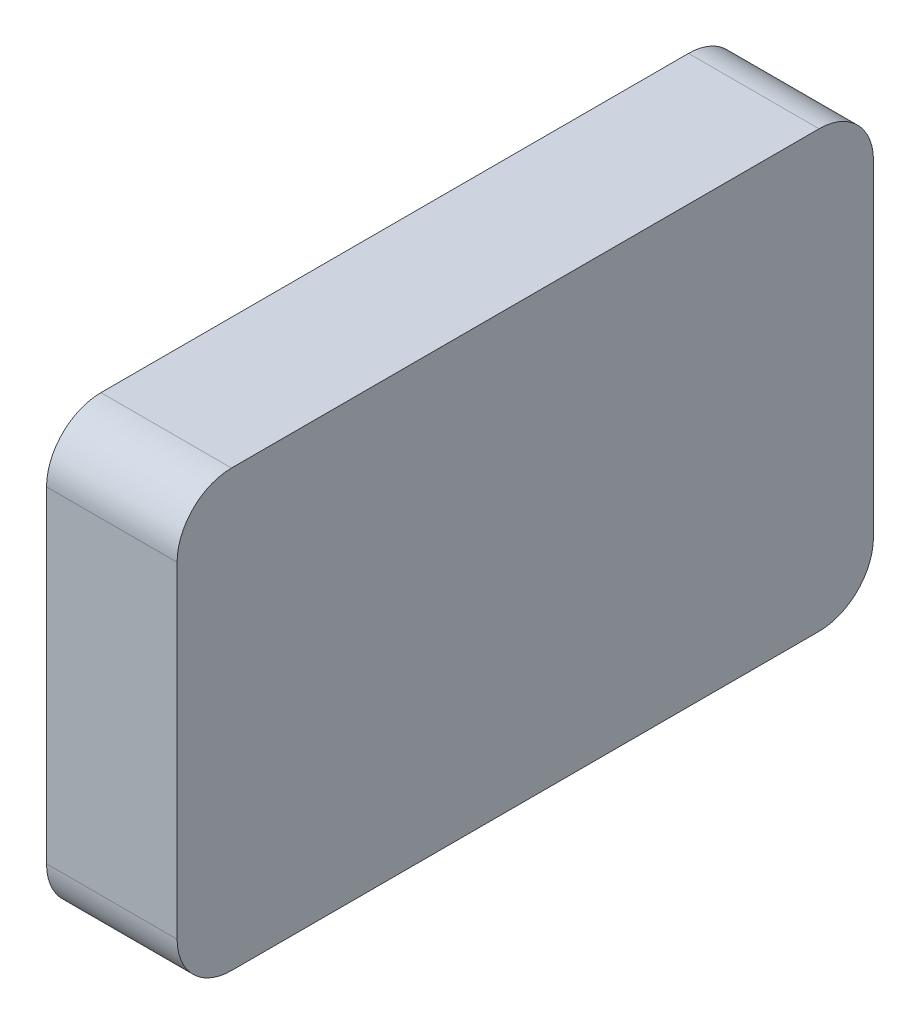
ISO-10303-21;
HEADER;
FILE_DESCRIPTION(('STEP AP214'),'2;1');
FILE_NAME('part.step','',(''),(''),'','','');
FILE_SCHEMA(('AUTOMOTIVE_DESIGN { 1 0 10303 214 1 1 1 1 }'));
ENDSEC;
DATA;
#1=APPLICATION_CONTEXT('core data for automotive mechanical design processes');
#2=APPLICATION_PROTOCOL_DEFINITION('international standard','automotive_design',2000,#1);
#3=PRODUCT_CONTEXT('',#1,'mechanical');
#4=PRODUCT('Part','Part','',(#3));
#5=PRODUCT_RELATED_PRODUCT_CATEGORY('part','',(#4));
#6=PRODUCT_DEFINITION_FORMATION('','',#4);
#7=PRODUCT_DEFINITION_CONTEXT('part definition',#1,'design');
#8=PRODUCT_DEFINITION('design','',#6,#7);
#9=PRODUCT_DEFINITION_SHAPE('','',#8);
#10=(LENGTH_UNIT() NAMED_UNIT(*) SI_UNIT(.MILLI.,.METRE.));
#11=(NAMED_UNIT(*) PLANE_ANGLE_UNIT() SI_UNIT($,.RADIAN.));
#12=(NAMED_UNIT(*) SI_UNIT($,.STERADIAN.) SOLID_ANGLE_UNIT());
#13=UNCERTAINTY_MEASURE_WITH_UNIT(LENGTH_MEASURE(1.E-05),#10,'distance_accuracy_value','');
#14=(GEOMETRIC_REPRESENTATION_CONTEXT(3) GLOBAL_UNCERTAINTY_ASSIGNED_CONTEXT((#13)) GLOBAL_UNIT_ASSIGNED_CONTEXT((#10,
#11,#12)) REPRESENTATION_CONTEXT('',''));
#15=CARTESIAN_POINT('',(0.,0.,0.));
#16=DIRECTION('',(0.,0.,1.));
#17=DIRECTION('',(1.,0.,0.));
#18=AXIS2_PLACEMENT_3D('',#15,#16,#17);
#19=CARTESIAN_POINT('',(12.,15.,-27.));
#20=DIRECTION('',(-1.,0.,0.));
#21=DIRECTION('',(0.,0.,1.));
#22=AXIS2_PLACEMENT_3D('',#19,#20,#21);
#23=CYLINDRICAL_SURFACE('',#22,5.00000000000001);
#24=CARTESIAN_POINT('',(0.,15.,-27.));
#25=DIRECTION('',(1.,0.,0.));
#26=DIRECTION('',(0.,0.,1.));
#27=AXIS2_PLACEMENT_3D('',#24,#25,#26);
#28=CIRCLE('',#27,5.00000000000001);
#29=CARTESIAN_POINT('',(0.,15.,-32.));
#30=VERTEX_POINT('',#29);
#31=CARTESIAN_POINT('',(0.,20.,-27.));
#32=VERTEX_POINT('',#31);
#33=EDGE_CURVE('E130',#30,#32,#28,.T.);
#34=ORIENTED_EDGE('',*,*,#33,.T.);
#35=DIRECTION('',(-1.,0.,0.));
#36=VECTOR('',#35,1.);
#37=CARTESIAN_POINT('',(12.,20.,-27.));
#38=LINE('',#37,#36);
#39=CARTESIAN_POINT('',(12.,20.,-27.));
#40=VERTEX_POINT('',#39);
#41=EDGE_CURVE('E11',#40,#32,#38,.T.);
#42=ORIENTED_EDGE('',*,*,#41,.F.);
#43=CARTESIAN_POINT('',(12.,15.,-27.));
#44=DIRECTION('',(1.,0.,0.));
#45=DIRECTION('',(0.,0.,1.));
#46=AXIS2_PLACEMENT_3D('',#43,#44,#45);
#47=CIRCLE('',#46,5.00000000000001);
#48=CARTESIAN_POINT('',(12.,15.,-32.));
#49=VERTEX_POINT('',#48);
#50=EDGE_CURVE('E145',#49,#40,#47,.T.);
#51=ORIENTED_EDGE('',*,*,#50,.F.);
#52=DIRECTION('',(-1.,0.,0.));
#53=VECTOR('',#52,1.);
#54=CARTESIAN_POINT('',(12.,15.,-32.));
#55=LINE('',#54,#53);
#56=EDGE_CURVE('E126',#49,#30,#55,.T.);
#57=ORIENTED_EDGE('',*,*,#56,.T.);
#58=EDGE_LOOP('',(#34,#42,#51,#57));
#59=FACE_BOUND('',#58,.T.);
#60=ADVANCED_FACE('F34',(#59),#23,.T.);
#61=CARTESIAN_POINT('',(12.,20.,27.));
#62=DIRECTION('',(0.,-1.,0.));
#63=DIRECTION('',(0.,0.,-1.));
#64=AXIS2_PLACEMENT_3D('',#61,#62,#63);
#65=PLANE('',#64);
#66=DIRECTION('',(0.,0.,1.));
#67=VECTOR('',#66,1.);
#68=CARTESIAN_POINT('',(0.,20.,27.));
#69=LINE('',#68,#67);
#70=CARTESIAN_POINT('',(0.,20.,27.));
#71=VERTEX_POINT('',#70);
#72=EDGE_CURVE('E133',#32,#71,#69,.T.);
#73=ORIENTED_EDGE('',*,*,#72,.T.);
#74=DIRECTION('',(-1.,0.,0.));
#75=VECTOR('',#74,1.);
#76=CARTESIAN_POINT('',(12.,20.,27.));
#77=LINE('',#76,#75);
#78=CARTESIAN_POINT('',(12.,20.,27.));
#79=VERTEX_POINT('',#78);
#80=EDGE_CURVE('E42',#79,#71,#77,.T.);
#81=ORIENTED_EDGE('',*,*,#80,.F.);
#82=DIRECTION('',(0.,0.,1.));
#83=VECTOR('',#82,1.);
#84=CARTESIAN_POINT('',(12.,20.,27.));
#85=LINE('',#84,#83);
#86=EDGE_CURVE('E93',#40,#79,#85,.T.);
#87=ORIENTED_EDGE('',*,*,#86,.F.);
#88=ORIENTED_EDGE('',*,*,#41,.T.);
#89=EDGE_LOOP('',(#73,#81,#87,#88));
#90=FACE_BOUND('',#89,.T.);
#91=ADVANCED_FACE('F209',(#90),#65,.F.);
#92=CARTESIAN_POINT('',(12.,15.,27.));
#93=DIRECTION('',(-1.,0.,0.));
#94=DIRECTION('',(0.,0.,1.));
#95=AXIS2_PLACEMENT_3D('',#92,#93,#94);
#96=CYLINDRICAL_SURFACE('',#95,5.);
#97=CARTESIAN_POINT('',(0.,15.,27.));
#98=DIRECTION('',(1.,0.,0.));
#99=DIRECTION('',(0.,0.,1.));
#100=AXIS2_PLACEMENT_3D('',#97,#98,#99);
#101=CIRCLE('',#100,5.);
#102=CARTESIAN_POINT('',(0.,15.,32.));
#103=VERTEX_POINT('',#102);
#104=EDGE_CURVE('E136',#71,#103,#101,.T.);
#105=ORIENTED_EDGE('',*,*,#104,.T.);
#106=DIRECTION('',(-1.,0.,0.));
#107=VECTOR('',#106,1.);
#108=CARTESIAN_POINT('',(12.,15.,32.));
#109=LINE('',#108,#107);
#110=CARTESIAN_POINT('',(12.,15.,32.));
#111=VERTEX_POINT('',#110);
#112=EDGE_CURVE('E152',#111,#103,#109,.T.);
#113=ORIENTED_EDGE('',*,*,#112,.F.);
#114=CARTESIAN_POINT('',(12.,15.,27.));
#115=DIRECTION('',(1.,0.,0.));
#116=DIRECTION('',(0.,0.,1.));
#117=AXIS2_PLACEMENT_3D('',#114,#115,#116);
#118=CIRCLE('',#117,5.);
#119=EDGE_CURVE('E160',#79,#111,#118,.T.);
#120=ORIENTED_EDGE('',*,*,#119,.F.);
#121=ORIENTED_EDGE('',*,*,#80,.T.);
#122=EDGE_LOOP('',(#105,#113,#120,#121));
#123=FACE_BOUND('',#122,.T.);
#124=ADVANCED_FACE('F158',(#123),#96,.T.);
#125=CARTESIAN_POINT('',(12.,15.,32.));
#126=DIRECTION('',(0.,0.,-1.));
#127=DIRECTION('',(-1.,0.,0.));
#128=AXIS2_PLACEMENT_3D('',#125,#126,#127);
#129=PLANE('',#128);
#130=DIRECTION('',(0.,-1.,0.));
#131=VECTOR('',#130,1.);
#132=CARTESIAN_POINT('',(0.,15.,32.));
#133=LINE('',#132,#131);
#134=CARTESIAN_POINT('',(0.,-15.,32.));
#135=VERTEX_POINT('',#134);
#136=EDGE_CURVE('E138',#103,#135,#133,.T.);
#137=ORIENTED_EDGE('',*,*,#136,.T.);
#138=DIRECTION('',(-1.,0.,0.));
#139=VECTOR('',#138,1.);
#140=CARTESIAN_POINT('',(12.,-15.,32.));
#141=LINE('',#140,#139);
#142=CARTESIAN_POINT('',(12.,-15.,32.));
#143=VERTEX_POINT('',#142);
#144=EDGE_CURVE('E149',#143,#135,#141,.T.);
#145=ORIENTED_EDGE('',*,*,#144,.F.);
#146=DIRECTION('',(0.,-1.,0.));
#147=VECTOR('',#146,1.);
#148=CARTESIAN_POINT('',(12.,15.,32.));
#149=LINE('',#148,#147);
#150=EDGE_CURVE('E172',#111,#143,#149,.T.);
#151=ORIENTED_EDGE('',*,*,#150,.F.);
#152=ORIENTED_EDGE('',*,*,#112,.T.);
#153=EDGE_LOOP('',(#137,#145,#151,#152));
#154=FACE_BOUND('',#153,.T.);
#155=ADVANCED_FACE('F168',(#154),#129,.F.);
#156=CARTESIAN_POINT('',(12.,-15.,27.));
#157=DIRECTION('',(-1.,0.,0.));
#158=DIRECTION('',(0.,0.,1.));
#159=AXIS2_PLACEMENT_3D('',#156,#157,#158);
#160=CYLINDRICAL_SURFACE('',#159,5.);
#161=CARTESIAN_POINT('',(0.,-15.,27.));
#162=DIRECTION('',(1.,0.,0.));
#163=DIRECTION('',(0.,0.,1.));
#164=AXIS2_PLACEMENT_3D('',#161,#162,#163);
#165=CIRCLE('',#164,5.);
#166=CARTESIAN_POINT('',(0.,-20.,27.));
#167=VERTEX_POINT('',#166);
#168=EDGE_CURVE('E140',#135,#167,#165,.T.);
#169=ORIENTED_EDGE('',*,*,#168,.T.);
#170=DIRECTION('',(-1.,0.,0.));
#171=VECTOR('',#170,1.);
#172=CARTESIAN_POINT('',(12.,-20.,27.));
#173=LINE('',#172,#171);
#174=CARTESIAN_POINT('',(12.,-20.,27.));
#175=VERTEX_POINT('',#174);
#176=EDGE_CURVE('E121',#175,#167,#173,.T.);
#177=ORIENTED_EDGE('',*,*,#176,.F.);
#178=CARTESIAN_POINT('',(12.,-15.,27.));
#179=DIRECTION('',(1.,0.,0.));
#180=DIRECTION('',(0.,0.,1.));
#181=AXIS2_PLACEMENT_3D('',#178,#179,#180);
#182=CIRCLE('',#181,5.);
#183=EDGE_CURVE('E112',#143,#175,#182,.T.);
#184=ORIENTED_EDGE('',*,*,#183,.F.);
#185=ORIENTED_EDGE('',*,*,#144,.T.);
#186=EDGE_LOOP('',(#169,#177,#184,#185));
#187=FACE_BOUND('',#186,.T.);
#188=ADVANCED_FACE('F171',(#187),#160,.T.);
#189=CARTESIAN_POINT('',(12.,-20.,27.));
#190=DIRECTION('',(0.,1.,0.));
#191=DIRECTION('',(0.,0.,1.));
#192=AXIS2_PLACEMENT_3D('',#189,#190,#191);
#193=PLANE('',#192);
#194=CARTESIAN_POINT('',(4.,-20.,0.));
#195=DIRECTION('',(0.,-1.,0.));
#196=DIRECTION('',(0.,0.,-1.));
#197=AXIS2_PLACEMENT_3D('',#194,#195,#196);
#198=CIRCLE('',#197,2.5);
#199=CARTESIAN_POINT('',(4.,-20.,-2.5));
#200=VERTEX_POINT('',#199);
#201=EDGE_CURVE('E184',#200,#200,#198,.T.);
#202=ORIENTED_EDGE('',*,*,#201,.F.);
#203=EDGE_LOOP('',(#202));
#204=FACE_BOUND('',#203,.T.);
#205=DIRECTION('',(0.,0.,-1.));
#206=VECTOR('',#205,1.);
#207=CARTESIAN_POINT('',(0.,-20.,27.));
#208=LINE('',#207,#206);
#209=CARTESIAN_POINT('',(0.,-20.,-27.));
#210=VERTEX_POINT('',#209);
#211=EDGE_CURVE('E120',#167,#210,#208,.T.);
#212=ORIENTED_EDGE('',*,*,#211,.T.);
#213=DIRECTION('',(-1.,0.,0.));
#214=VECTOR('',#213,1.);
#215=CARTESIAN_POINT('',(12.,-20.,-27.));
#216=LINE('',#215,#214);
#217=CARTESIAN_POINT('',(12.,-20.,-27.));
#218=VERTEX_POINT('',#217);
#219=EDGE_CURVE('E117',#218,#210,#216,.T.);
#220=ORIENTED_EDGE('',*,*,#219,.F.);
#221=DIRECTION('',(0.,0.,-1.));
#222=VECTOR('',#221,1.);
#223=CARTESIAN_POINT('',(12.,-20.,27.));
#224=LINE('',#223,#222);
#225=EDGE_CURVE('E106',#175,#218,#224,.T.);
#226=ORIENTED_EDGE('',*,*,#225,.F.);
#227=ORIENTED_EDGE('',*,*,#176,.T.);
#228=EDGE_LOOP('',(#212,#220,#226,#227));
#229=FACE_BOUND('',#228,.T.);
#230=ADVANCED_FACE('F118',(#204,#229),#193,.F.);
#231=CARTESIAN_POINT('',(12.,-15.,-27.));
#232=DIRECTION('',(-1.,0.,0.));
#233=DIRECTION('',(0.,0.,1.));
#234=AXIS2_PLACEMENT_3D('',#231,#232,#233);
#235=CYLINDRICAL_SURFACE('',#234,5.00000000000001);
#236=CARTESIAN_POINT('',(0.,-15.,-27.));
#237=DIRECTION('',(1.,0.,0.));
#238=DIRECTION('',(0.,0.,-1.));
#239=AXIS2_PLACEMENT_3D('',#236,#237,#238);
#240=CIRCLE('',#239,5.00000000000001);
#241=CARTESIAN_POINT('',(0.,-15.,-32.));
#242=VERTEX_POINT('',#241);
#243=EDGE_CURVE('E79',#210,#242,#240,.T.);
#244=ORIENTED_EDGE('',*,*,#243,.T.);
#245=DIRECTION('',(-1.,0.,0.));
#246=VECTOR('',#245,1.);
#247=CARTESIAN_POINT('',(12.,-15.,-32.));
#248=LINE('',#247,#246);
#249=CARTESIAN_POINT('',(12.,-15.,-32.));
#250=VERTEX_POINT('',#249);
#251=EDGE_CURVE('E122',#250,#242,#248,.T.);
#252=ORIENTED_EDGE('',*,*,#251,.F.);
#253=CARTESIAN_POINT('',(12.,-15.,-27.));
#254=DIRECTION('',(1.,0.,0.));
#255=DIRECTION('',(0.,0.,-1.));
#256=AXIS2_PLACEMENT_3D('',#253,#254,#255);
#257=CIRCLE('',#256,5.00000000000001);
#258=EDGE_CURVE('E110',#218,#250,#257,.T.);
#259=ORIENTED_EDGE('',*,*,#258,.F.);
#260=ORIENTED_EDGE('',*,*,#219,.T.);
#261=EDGE_LOOP('',(#244,#252,#259,#260));
#262=FACE_BOUND('',#261,.T.);
#263=ADVANCED_FACE('F124',(#262),#235,.T.);
#264=CARTESIAN_POINT('',(12.,15.,-32.));
#265=DIRECTION('',(0.,0.,1.));
#266=DIRECTION('',(0.,-1.,0.));
#267=AXIS2_PLACEMENT_3D('',#264,#265,#266);
#268=PLANE('',#267);
#269=DIRECTION('',(0.,1.,0.));
#270=VECTOR('',#269,1.);
#271=CARTESIAN_POINT('',(0.,15.,-32.));
#272=LINE('',#271,#270);
#273=EDGE_CURVE('E85',#242,#30,#272,.T.);
#274=ORIENTED_EDGE('',*,*,#273,.T.);
#275=ORIENTED_EDGE('',*,*,#56,.F.);
#276=DIRECTION('',(0.,1.,0.));
#277=VECTOR('',#276,1.);
#278=CARTESIAN_POINT('',(12.,15.,-32.));
#279=LINE('',#278,#277);
#280=EDGE_CURVE('E50',#250,#49,#279,.T.);
#281=ORIENTED_EDGE('',*,*,#280,.F.);
#282=ORIENTED_EDGE('',*,*,#251,.T.);
#283=EDGE_LOOP('',(#274,#275,#281,#282));
#284=FACE_BOUND('',#283,.T.);
#285=ADVANCED_FACE('F205',(#284),#268,.F.);
#286=CARTESIAN_POINT('',(12.,15.,-27.));
#287=DIRECTION('',(-1.,0.,0.));
#288=DIRECTION('',(0.,0.,1.));
#289=AXIS2_PLACEMENT_3D('',#286,#287,#288);
#290=PLANE('',#289);
#291=ORIENTED_EDGE('',*,*,#50,.T.);
#292=ORIENTED_EDGE('',*,*,#86,.T.);
#293=ORIENTED_EDGE('',*,*,#119,.T.);
#294=ORIENTED_EDGE('',*,*,#150,.T.);
#295=ORIENTED_EDGE('',*,*,#183,.T.);
#296=ORIENTED_EDGE('',*,*,#225,.T.);
#297=ORIENTED_EDGE('',*,*,#258,.T.);
#298=ORIENTED_EDGE('',*,*,#280,.T.);
#299=EDGE_LOOP('',(#291,#292,#293,#294,#295,#296,#297,#298));
#300=FACE_BOUND('',#299,.T.);
#301=ADVANCED_FACE('F108',(#300),#290,.F.);
#302=CARTESIAN_POINT('',(0.,15.,-27.));
#303=DIRECTION('',(-1.,0.,0.));
#304=DIRECTION('',(0.,0.,1.));
#305=AXIS2_PLACEMENT_3D('',#302,#303,#304);
#306=PLANE('',#305);
#307=CARTESIAN_POINT('',(0.,0.,0.));
#308=DIRECTION('',(-1.,0.,0.));
#309=DIRECTION('',(0.,0.,1.));
#310=AXIS2_PLACEMENT_3D('',#307,#308,#309);
#311=CIRCLE('',#310,8.);
#312=CARTESIAN_POINT('',(0.,0.,8.));
#313=VERTEX_POINT('',#312);
#314=EDGE_CURVE('E178',#313,#313,#311,.T.);
#315=ORIENTED_EDGE('',*,*,#314,.F.);
#316=EDGE_LOOP('',(#315));
#317=FACE_BOUND('',#316,.T.);
#318=ORIENTED_EDGE('',*,*,#33,.F.);
#319=ORIENTED_EDGE('',*,*,#273,.F.);
#320=ORIENTED_EDGE('',*,*,#243,.F.);
#321=ORIENTED_EDGE('',*,*,#211,.F.);
#322=ORIENTED_EDGE('',*,*,#168,.F.);
#323=ORIENTED_EDGE('',*,*,#136,.F.);
#324=ORIENTED_EDGE('',*,*,#104,.F.);
#325=ORIENTED_EDGE('',*,*,#72,.F.);
#326=EDGE_LOOP('',(#318,#319,#320,#321,#322,#323,#324,#325));
#327=FACE_BOUND('',#326,.T.);
#328=ADVANCED_FACE('F164',(#317,#327),#306,.T.);
#329=CARTESIAN_POINT('',(8.,0.,0.));
#330=DIRECTION('',(-1.,0.,0.));
#331=DIRECTION('',(0.,0.,1.));
#332=AXIS2_PLACEMENT_3D('',#329,#330,#331);
#333=CYLINDRICAL_SURFACE('',#332,8.);
#334=CARTESIAN_POINT('',(8.,0.,0.));
#335=DIRECTION('',(-1.,0.,0.));
#336=DIRECTION('',(0.,0.,1.));
#337=AXIS2_PLACEMENT_3D('',#334,#335,#336);
#338=CIRCLE('',#337,8.);
#339=CARTESIAN_POINT('',(8.,0.,8.));
#340=VERTEX_POINT('',#339);
#341=EDGE_CURVE('E134',#340,#340,#338,.T.);
#342=ORIENTED_EDGE('',*,*,#341,.F.);
#343=EDGE_LOOP('',(#342));
#344=FACE_BOUND('',#343,.T.);
#345=ORIENTED_EDGE('',*,*,#314,.T.);
#346=EDGE_LOOP('',(#345));
#347=FACE_BOUND('',#346,.T.);
#348=ADVANCED_FACE('F224',(#344,#347),#333,.F.);
#349=CARTESIAN_POINT('',(8.,0.,0.));
#350=DIRECTION('',(-1.,0.,0.));
#351=DIRECTION('',(0.,0.,1.));
#352=AXIS2_PLACEMENT_3D('',#349,#350,#351);
#353=PLANE('',#352);
#354=ORIENTED_EDGE('',*,*,#341,.T.);
#355=EDGE_LOOP('',(#354));
#356=FACE_BOUND('',#355,.T.);
#357=ADVANCED_FACE('F195',(#356),#353,.T.);
#358=CARTESIAN_POINT('',(4.,-10.,0.));
#359=DIRECTION('',(0.,-1.,0.));
#360=DIRECTION('',(0.,0.,-1.));
#361=AXIS2_PLACEMENT_3D('',#358,#359,#360);
#362=CYLINDRICAL_SURFACE('',#361,2.5);
#363=CARTESIAN_POINT('',(4.,-10.,0.));
#364=DIRECTION('',(0.,-1.,0.));
#365=DIRECTION('',(0.,0.,-1.));
#366=AXIS2_PLACEMENT_3D('',#363,#364,#365);
#367=CIRCLE('',#366,2.5);
#368=CARTESIAN_POINT('',(4.,-10.,-2.5));
#369=VERTEX_POINT('',#368);
#370=EDGE_CURVE('E181',#369,#369,#367,.T.);
#371=ORIENTED_EDGE('',*,*,#370,.F.);
#372=EDGE_LOOP('',(#371));
#373=FACE_BOUND('',#372,.T.);
#374=ORIENTED_EDGE('',*,*,#201,.T.);
#375=EDGE_LOOP('',(#374));
#376=FACE_BOUND('',#375,.T.);
#377=ADVANCED_FACE('F192',(#373,#376),#362,.F.);
#378=CARTESIAN_POINT('',(4.,-10.,0.));
#379=DIRECTION('',(0.,-1.,0.));
#380=DIRECTION('',(0.,0.,-1.));
#381=AXIS2_PLACEMENT_3D('',#378,#379,#380);
#382=PLANE('',#381);
#383=ORIENTED_EDGE('',*,*,#370,.T.);
#384=EDGE_LOOP('',(#383));
#385=FACE_BOUND('',#384,.T.);
#386=ADVANCED_FACE('F190',(#385),#382,.T.);
#387=CLOSED_SHELL('',(#60,#91,#124,#155,#188,#230,#263,#285,#301,#328,#348,#357,#377,#386));
#388=MANIFOLD_SOLID_BREP('B2',#387);
#389=ADVANCED_BREP_SHAPE_REPRESENTATION('',(#18,#388),#14);
#390=SHAPE_DEFINITION_REPRESENTATION(#9,#389);
ENDSEC;
END-ISO-10303-21;
